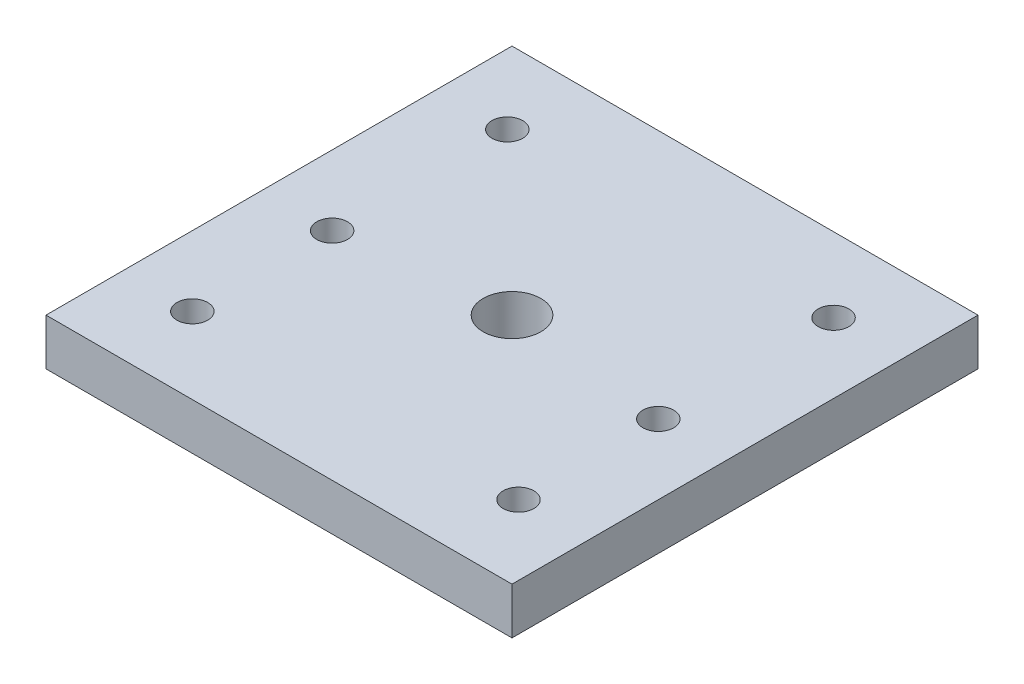
ISO-10303-21;
HEADER;
FILE_DESCRIPTION(('STEP AP214'),'2;1');
FILE_NAME('part.step','',(''),(''),'','','');
FILE_SCHEMA(('AUTOMOTIVE_DESIGN { 1 0 10303 214 1 1 1 1 }'));
ENDSEC;
DATA;
#1=APPLICATION_CONTEXT('core data for automotive mechanical design processes');
#2=APPLICATION_PROTOCOL_DEFINITION('international standard','automotive_design',2000,#1);
#3=PRODUCT_CONTEXT('',#1,'mechanical');
#4=PRODUCT('Part','Part','',(#3));
#5=PRODUCT_RELATED_PRODUCT_CATEGORY('part','',(#4));
#6=PRODUCT_DEFINITION_FORMATION('','',#4);
#7=PRODUCT_DEFINITION_CONTEXT('part definition',#1,'design');
#8=PRODUCT_DEFINITION('design','',#6,#7);
#9=PRODUCT_DEFINITION_SHAPE('','',#8);
#10=(LENGTH_UNIT() NAMED_UNIT(*) SI_UNIT(.MILLI.,.METRE.));
#11=(NAMED_UNIT(*) PLANE_ANGLE_UNIT() SI_UNIT($,.RADIAN.));
#12=(NAMED_UNIT(*) SI_UNIT($,.STERADIAN.) SOLID_ANGLE_UNIT());
#13=UNCERTAINTY_MEASURE_WITH_UNIT(LENGTH_MEASURE(1.E-05),#10,'distance_accuracy_value','');
#14=(GEOMETRIC_REPRESENTATION_CONTEXT(3) GLOBAL_UNCERTAINTY_ASSIGNED_CONTEXT((#13)) GLOBAL_UNIT_ASSIGNED_CONTEXT((#10,
#11,#12)) REPRESENTATION_CONTEXT('',''));
#15=CARTESIAN_POINT('',(0.,0.,0.));
#16=DIRECTION('',(0.,0.,1.));
#17=DIRECTION('',(1.,0.,0.));
#18=AXIS2_PLACEMENT_3D('',#15,#16,#17);
#19=CARTESIAN_POINT('',(-63.5,12.7,63.5));
#20=DIRECTION('',(1.,0.,0.));
#21=DIRECTION('',(0.,0.,-1.));
#22=AXIS2_PLACEMENT_3D('',#19,#20,#21);
#23=PLANE('',#22);
#24=DIRECTION('',(0.,0.,1.));
#25=VECTOR('',#24,1.);
#26=CARTESIAN_POINT('',(-63.5,0.,63.5));
#27=LINE('',#26,#25);
#28=CARTESIAN_POINT('',(-63.5,0.,-63.5));
#29=VERTEX_POINT('',#28);
#30=CARTESIAN_POINT('',(-63.5,0.,63.5));
#31=VERTEX_POINT('',#30);
#32=EDGE_CURVE('E107',#29,#31,#27,.T.);
#33=ORIENTED_EDGE('',*,*,#32,.T.);
#34=DIRECTION('',(0.,-1.,0.));
#35=VECTOR('',#34,1.);
#36=CARTESIAN_POINT('',(-63.5,12.7,63.5));
#37=LINE('',#36,#35);
#38=CARTESIAN_POINT('',(-63.5,12.7,63.5));
#39=VERTEX_POINT('',#38);
#40=EDGE_CURVE('E11',#39,#31,#37,.T.);
#41=ORIENTED_EDGE('',*,*,#40,.F.);
#42=DIRECTION('',(0.,0.,1.));
#43=VECTOR('',#42,1.);
#44=CARTESIAN_POINT('',(-63.5,12.7,63.5));
#45=LINE('',#44,#43);
#46=CARTESIAN_POINT('',(-63.5,12.7,-63.5));
#47=VERTEX_POINT('',#46);
#48=EDGE_CURVE('E91',#47,#39,#45,.T.);
#49=ORIENTED_EDGE('',*,*,#48,.F.);
#50=DIRECTION('',(0.,-1.,0.));
#51=VECTOR('',#50,1.);
#52=CARTESIAN_POINT('',(-63.5,12.7,-63.5));
#53=LINE('',#52,#51);
#54=EDGE_CURVE('E103',#47,#29,#53,.T.);
#55=ORIENTED_EDGE('',*,*,#54,.T.);
#56=EDGE_LOOP('',(#33,#41,#49,#55));
#57=FACE_BOUND('',#56,.T.);
#58=ADVANCED_FACE('F39',(#57),#23,.F.);
#59=CARTESIAN_POINT('',(63.5,12.7,63.5));
#60=DIRECTION('',(0.,0.,-1.));
#61=DIRECTION('',(-1.,0.,0.));
#62=AXIS2_PLACEMENT_3D('',#59,#60,#61);
#63=PLANE('',#62);
#64=DIRECTION('',(1.,0.,0.));
#65=VECTOR('',#64,1.);
#66=CARTESIAN_POINT('',(63.5,0.,63.5));
#67=LINE('',#66,#65);
#68=CARTESIAN_POINT('',(63.5,0.,63.5));
#69=VERTEX_POINT('',#68);
#70=EDGE_CURVE('E96',#31,#69,#67,.T.);
#71=ORIENTED_EDGE('',*,*,#70,.T.);
#72=DIRECTION('',(0.,-1.,0.));
#73=VECTOR('',#72,1.);
#74=CARTESIAN_POINT('',(63.5,12.7,63.5));
#75=LINE('',#74,#73);
#76=CARTESIAN_POINT('',(63.5,12.7,63.5));
#77=VERTEX_POINT('',#76);
#78=EDGE_CURVE('E48',#77,#69,#75,.T.);
#79=ORIENTED_EDGE('',*,*,#78,.F.);
#80=DIRECTION('',(1.,0.,0.));
#81=VECTOR('',#80,1.);
#82=CARTESIAN_POINT('',(63.5,12.7,63.5));
#83=LINE('',#82,#81);
#84=EDGE_CURVE('E86',#39,#77,#83,.T.);
#85=ORIENTED_EDGE('',*,*,#84,.F.);
#86=ORIENTED_EDGE('',*,*,#40,.T.);
#87=EDGE_LOOP('',(#71,#79,#85,#86));
#88=FACE_BOUND('',#87,.T.);
#89=ADVANCED_FACE('F95',(#88),#63,.F.);
#90=CARTESIAN_POINT('',(63.5,12.7,63.5));
#91=DIRECTION('',(-1.,0.,0.));
#92=DIRECTION('',(0.,0.,1.));
#93=AXIS2_PLACEMENT_3D('',#90,#91,#92);
#94=PLANE('',#93);
#95=DIRECTION('',(0.,0.,-1.));
#96=VECTOR('',#95,1.);
#97=CARTESIAN_POINT('',(63.5,0.,63.5));
#98=LINE('',#97,#96);
#99=CARTESIAN_POINT('',(63.5,0.,-63.5));
#100=VERTEX_POINT('',#99);
#101=EDGE_CURVE('E73',#69,#100,#98,.T.);
#102=ORIENTED_EDGE('',*,*,#101,.T.);
#103=DIRECTION('',(0.,-1.,0.));
#104=VECTOR('',#103,1.);
#105=CARTESIAN_POINT('',(63.5,12.7,-63.5));
#106=LINE('',#105,#104);
#107=CARTESIAN_POINT('',(63.5,12.7,-63.5));
#108=VERTEX_POINT('',#107);
#109=EDGE_CURVE('E98',#108,#100,#106,.T.);
#110=ORIENTED_EDGE('',*,*,#109,.F.);
#111=DIRECTION('',(0.,0.,-1.));
#112=VECTOR('',#111,1.);
#113=CARTESIAN_POINT('',(63.5,12.7,63.5));
#114=LINE('',#113,#112);
#115=EDGE_CURVE('E89',#77,#108,#114,.T.);
#116=ORIENTED_EDGE('',*,*,#115,.F.);
#117=ORIENTED_EDGE('',*,*,#78,.T.);
#118=EDGE_LOOP('',(#102,#110,#116,#117));
#119=FACE_BOUND('',#118,.T.);
#120=ADVANCED_FACE('F99',(#119),#94,.F.);
#121=CARTESIAN_POINT('',(63.5,12.7,-63.5));
#122=DIRECTION('',(0.,0.,1.));
#123=DIRECTION('',(1.,0.,0.));
#124=AXIS2_PLACEMENT_3D('',#121,#122,#123);
#125=PLANE('',#124);
#126=DIRECTION('',(-1.,0.,0.));
#127=VECTOR('',#126,1.);
#128=CARTESIAN_POINT('',(63.5,0.,-63.5));
#129=LINE('',#128,#127);
#130=EDGE_CURVE('E79',#100,#29,#129,.T.);
#131=ORIENTED_EDGE('',*,*,#130,.T.);
#132=ORIENTED_EDGE('',*,*,#54,.F.);
#133=DIRECTION('',(-1.,0.,0.));
#134=VECTOR('',#133,1.);
#135=CARTESIAN_POINT('',(63.5,12.7,-63.5));
#136=LINE('',#135,#134);
#137=EDGE_CURVE('E56',#108,#47,#136,.T.);
#138=ORIENTED_EDGE('',*,*,#137,.F.);
#139=ORIENTED_EDGE('',*,*,#109,.T.);
#140=EDGE_LOOP('',(#131,#132,#138,#139));
#141=FACE_BOUND('',#140,.T.);
#142=ADVANCED_FACE('F121',(#141),#125,.F.);
#143=CARTESIAN_POINT('',(0.,12.7,0.));
#144=DIRECTION('',(0.,1.,0.));
#145=DIRECTION('',(0.,0.,1.));
#146=AXIS2_PLACEMENT_3D('',#143,#144,#145);
#147=PLANE('',#146);
#148=CARTESIAN_POINT('',(0.,12.7,0.));
#149=DIRECTION('',(0.,-1.,0.));
#150=DIRECTION('',(0.,0.,-1.));
#151=AXIS2_PLACEMENT_3D('',#148,#149,#150);
#152=CIRCLE('',#151,7.874);
#153=CARTESIAN_POINT('',(0.,12.7,-7.874));
#154=VERTEX_POINT('',#153);
#155=EDGE_CURVE('E175',#154,#154,#152,.T.);
#156=ORIENTED_EDGE('',*,*,#155,.T.);
#157=EDGE_LOOP('',(#156));
#158=FACE_BOUND('',#157,.T.);
#159=CARTESIAN_POINT('',(44.45,12.7,-43.18));
#160=DIRECTION('',(0.,-1.,0.));
#161=DIRECTION('',(0.,0.,-1.));
#162=AXIS2_PLACEMENT_3D('',#159,#160,#161);
#163=CIRCLE('',#162,4.191);
#164=CARTESIAN_POINT('',(44.45,12.7,-47.371));
#165=VERTEX_POINT('',#164);
#166=EDGE_CURVE('E167',#165,#165,#163,.T.);
#167=ORIENTED_EDGE('',*,*,#166,.T.);
#168=EDGE_LOOP('',(#167));
#169=FACE_BOUND('',#168,.T.);
#170=CARTESIAN_POINT('',(44.45,12.7,4.572));
#171=DIRECTION('',(0.,-1.,0.));
#172=DIRECTION('',(0.,0.,-1.));
#173=AXIS2_PLACEMENT_3D('',#170,#171,#172);
#174=CIRCLE('',#173,4.191);
#175=CARTESIAN_POINT('',(44.45,12.7,0.381000000000003));
#176=VERTEX_POINT('',#175);
#177=EDGE_CURVE('E159',#176,#176,#174,.T.);
#178=ORIENTED_EDGE('',*,*,#177,.T.);
#179=EDGE_LOOP('',(#178));
#180=FACE_BOUND('',#179,.T.);
#181=CARTESIAN_POINT('',(44.45,12.7,42.672));
#182=DIRECTION('',(0.,-1.,0.));
#183=DIRECTION('',(0.,0.,-1.));
#184=AXIS2_PLACEMENT_3D('',#181,#182,#183);
#185=CIRCLE('',#184,4.191);
#186=CARTESIAN_POINT('',(44.45,12.7,38.481));
#187=VERTEX_POINT('',#186);
#188=EDGE_CURVE('E151',#187,#187,#185,.T.);
#189=ORIENTED_EDGE('',*,*,#188,.T.);
#190=EDGE_LOOP('',(#189));
#191=FACE_BOUND('',#190,.T.);
#192=CARTESIAN_POINT('',(-44.45,12.7,-43.18));
#193=DIRECTION('',(0.,-1.,0.));
#194=DIRECTION('',(0.,0.,-1.));
#195=AXIS2_PLACEMENT_3D('',#192,#193,#194);
#196=CIRCLE('',#195,4.191);
#197=CARTESIAN_POINT('',(-44.45,12.7,-47.371));
#198=VERTEX_POINT('',#197);
#199=EDGE_CURVE('E143',#198,#198,#196,.T.);
#200=ORIENTED_EDGE('',*,*,#199,.T.);
#201=EDGE_LOOP('',(#200));
#202=FACE_BOUND('',#201,.T.);
#203=CARTESIAN_POINT('',(-44.45,12.7,4.572));
#204=DIRECTION('',(0.,-1.,0.));
#205=DIRECTION('',(0.,0.,-1.));
#206=AXIS2_PLACEMENT_3D('',#203,#204,#205);
#207=CIRCLE('',#206,4.19099999999999);
#208=CARTESIAN_POINT('',(-44.45,12.7,0.381000000000006));
#209=VERTEX_POINT('',#208);
#210=EDGE_CURVE('E135',#209,#209,#207,.T.);
#211=ORIENTED_EDGE('',*,*,#210,.T.);
#212=EDGE_LOOP('',(#211));
#213=FACE_BOUND('',#212,.T.);
#214=CARTESIAN_POINT('',(-44.45,12.7,42.672));
#215=DIRECTION('',(0.,-1.,0.));
#216=DIRECTION('',(0.,0.,-1.));
#217=AXIS2_PLACEMENT_3D('',#214,#215,#216);
#218=CIRCLE('',#217,4.191);
#219=CARTESIAN_POINT('',(-44.45,12.7,38.481));
#220=VERTEX_POINT('',#219);
#221=EDGE_CURVE('E111',#220,#220,#218,.T.);
#222=ORIENTED_EDGE('',*,*,#221,.T.);
#223=EDGE_LOOP('',(#222));
#224=FACE_BOUND('',#223,.T.);
#225=ORIENTED_EDGE('',*,*,#48,.T.);
#226=ORIENTED_EDGE('',*,*,#84,.T.);
#227=ORIENTED_EDGE('',*,*,#115,.T.);
#228=ORIENTED_EDGE('',*,*,#137,.T.);
#229=EDGE_LOOP('',(#225,#226,#227,#228));
#230=FACE_BOUND('',#229,.T.);
#231=ADVANCED_FACE('F87',(#158,#169,#180,#191,#202,#213,#224,#230),#147,.T.);
#232=CARTESIAN_POINT('',(0.,0.,0.));
#233=DIRECTION('',(0.,1.,0.));
#234=DIRECTION('',(0.,0.,1.));
#235=AXIS2_PLACEMENT_3D('',#232,#233,#234);
#236=PLANE('',#235);
#237=CARTESIAN_POINT('',(0.,0.,0.));
#238=DIRECTION('',(0.,-1.,0.));
#239=DIRECTION('',(0.,0.,-1.));
#240=AXIS2_PLACEMENT_3D('',#237,#238,#239);
#241=CIRCLE('',#240,7.874);
#242=CARTESIAN_POINT('',(0.,0.,-7.874));
#243=VERTEX_POINT('',#242);
#244=EDGE_CURVE('E176',#243,#243,#241,.T.);
#245=ORIENTED_EDGE('',*,*,#244,.F.);
#246=EDGE_LOOP('',(#245));
#247=FACE_BOUND('',#246,.T.);
#248=CARTESIAN_POINT('',(44.45,0.,-43.18));
#249=DIRECTION('',(0.,-1.,0.));
#250=DIRECTION('',(0.,0.,-1.));
#251=AXIS2_PLACEMENT_3D('',#248,#249,#250);
#252=CIRCLE('',#251,4.191);
#253=CARTESIAN_POINT('',(44.45,0.,-47.371));
#254=VERTEX_POINT('',#253);
#255=EDGE_CURVE('E171',#254,#254,#252,.T.);
#256=ORIENTED_EDGE('',*,*,#255,.F.);
#257=EDGE_LOOP('',(#256));
#258=FACE_BOUND('',#257,.T.);
#259=CARTESIAN_POINT('',(44.45,0.,4.572));
#260=DIRECTION('',(0.,-1.,0.));
#261=DIRECTION('',(0.,0.,-1.));
#262=AXIS2_PLACEMENT_3D('',#259,#260,#261);
#263=CIRCLE('',#262,4.191);
#264=CARTESIAN_POINT('',(44.45,0.,0.381000000000003));
#265=VERTEX_POINT('',#264);
#266=EDGE_CURVE('E163',#265,#265,#263,.T.);
#267=ORIENTED_EDGE('',*,*,#266,.F.);
#268=EDGE_LOOP('',(#267));
#269=FACE_BOUND('',#268,.T.);
#270=CARTESIAN_POINT('',(44.45,0.,42.672));
#271=DIRECTION('',(0.,-1.,0.));
#272=DIRECTION('',(0.,0.,-1.));
#273=AXIS2_PLACEMENT_3D('',#270,#271,#272);
#274=CIRCLE('',#273,4.191);
#275=CARTESIAN_POINT('',(44.45,0.,38.481));
#276=VERTEX_POINT('',#275);
#277=EDGE_CURVE('E155',#276,#276,#274,.T.);
#278=ORIENTED_EDGE('',*,*,#277,.F.);
#279=EDGE_LOOP('',(#278));
#280=FACE_BOUND('',#279,.T.);
#281=CARTESIAN_POINT('',(-44.45,0.,-43.18));
#282=DIRECTION('',(0.,-1.,0.));
#283=DIRECTION('',(0.,0.,-1.));
#284=AXIS2_PLACEMENT_3D('',#281,#282,#283);
#285=CIRCLE('',#284,4.191);
#286=CARTESIAN_POINT('',(-44.45,0.,-47.371));
#287=VERTEX_POINT('',#286);
#288=EDGE_CURVE('E147',#287,#287,#285,.T.);
#289=ORIENTED_EDGE('',*,*,#288,.F.);
#290=EDGE_LOOP('',(#289));
#291=FACE_BOUND('',#290,.T.);
#292=CARTESIAN_POINT('',(-44.45,0.,4.572));
#293=DIRECTION('',(0.,-1.,0.));
#294=DIRECTION('',(0.,0.,-1.));
#295=AXIS2_PLACEMENT_3D('',#292,#293,#294);
#296=CIRCLE('',#295,4.191);
#297=CARTESIAN_POINT('',(-44.45,0.,0.380999999999999));
#298=VERTEX_POINT('',#297);
#299=EDGE_CURVE('E139',#298,#298,#296,.T.);
#300=ORIENTED_EDGE('',*,*,#299,.F.);
#301=EDGE_LOOP('',(#300));
#302=FACE_BOUND('',#301,.T.);
#303=CARTESIAN_POINT('',(-44.45,0.,42.672));
#304=DIRECTION('',(0.,-1.,0.));
#305=DIRECTION('',(0.,0.,-1.));
#306=AXIS2_PLACEMENT_3D('',#303,#304,#305);
#307=CIRCLE('',#306,4.191);
#308=CARTESIAN_POINT('',(-44.45,0.,38.481));
#309=VERTEX_POINT('',#308);
#310=EDGE_CURVE('E131',#309,#309,#307,.T.);
#311=ORIENTED_EDGE('',*,*,#310,.F.);
#312=EDGE_LOOP('',(#311));
#313=FACE_BOUND('',#312,.T.);
#314=ORIENTED_EDGE('',*,*,#32,.F.);
#315=ORIENTED_EDGE('',*,*,#130,.F.);
#316=ORIENTED_EDGE('',*,*,#101,.F.);
#317=ORIENTED_EDGE('',*,*,#70,.F.);
#318=EDGE_LOOP('',(#314,#315,#316,#317));
#319=FACE_BOUND('',#318,.T.);
#320=ADVANCED_FACE('F124',(#247,#258,#269,#280,#291,#302,#313,#319),#236,.F.);
#321=CARTESIAN_POINT('',(-44.45,0.,42.672));
#322=DIRECTION('',(0.,-1.,0.));
#323=DIRECTION('',(0.,0.,-1.));
#324=AXIS2_PLACEMENT_3D('',#321,#322,#323);
#325=CYLINDRICAL_SURFACE('',#324,4.191);
#326=ORIENTED_EDGE('',*,*,#221,.F.);
#327=EDGE_LOOP('',(#326));
#328=FACE_BOUND('',#327,.T.);
#329=ORIENTED_EDGE('',*,*,#310,.T.);
#330=EDGE_LOOP('',(#329));
#331=FACE_BOUND('',#330,.T.);
#332=ADVANCED_FACE('F195',(#328,#331),#325,.F.);
#333=CARTESIAN_POINT('',(-44.45,0.,4.572));
#334=DIRECTION('',(0.,-1.,0.));
#335=DIRECTION('',(0.,0.,-1.));
#336=AXIS2_PLACEMENT_3D('',#333,#334,#335);
#337=CYLINDRICAL_SURFACE('',#336,4.191);
#338=ORIENTED_EDGE('',*,*,#210,.F.);
#339=EDGE_LOOP('',(#338));
#340=FACE_BOUND('',#339,.T.);
#341=ORIENTED_EDGE('',*,*,#299,.T.);
#342=EDGE_LOOP('',(#341));
#343=FACE_BOUND('',#342,.T.);
#344=ADVANCED_FACE('F210',(#340,#343),#337,.F.);
#345=CARTESIAN_POINT('',(-44.45,0.,-43.18));
#346=DIRECTION('',(0.,-1.,0.));
#347=DIRECTION('',(0.,0.,-1.));
#348=AXIS2_PLACEMENT_3D('',#345,#346,#347);
#349=CYLINDRICAL_SURFACE('',#348,4.191);
#350=ORIENTED_EDGE('',*,*,#199,.F.);
#351=EDGE_LOOP('',(#350));
#352=FACE_BOUND('',#351,.T.);
#353=ORIENTED_EDGE('',*,*,#288,.T.);
#354=EDGE_LOOP('',(#353));
#355=FACE_BOUND('',#354,.T.);
#356=ADVANCED_FACE('F216',(#352,#355),#349,.F.);
#357=CARTESIAN_POINT('',(44.45,0.,42.672));
#358=DIRECTION('',(0.,-1.,0.));
#359=DIRECTION('',(0.,0.,-1.));
#360=AXIS2_PLACEMENT_3D('',#357,#358,#359);
#361=CYLINDRICAL_SURFACE('',#360,4.191);
#362=ORIENTED_EDGE('',*,*,#188,.F.);
#363=EDGE_LOOP('',(#362));
#364=FACE_BOUND('',#363,.T.);
#365=ORIENTED_EDGE('',*,*,#277,.T.);
#366=EDGE_LOOP('',(#365));
#367=FACE_BOUND('',#366,.T.);
#368=ADVANCED_FACE('F263',(#364,#367),#361,.F.);
#369=CARTESIAN_POINT('',(44.45,0.,4.572));
#370=DIRECTION('',(0.,-1.,0.));
#371=DIRECTION('',(0.,0.,-1.));
#372=AXIS2_PLACEMENT_3D('',#369,#370,#371);
#373=CYLINDRICAL_SURFACE('',#372,4.191);
#374=ORIENTED_EDGE('',*,*,#177,.F.);
#375=EDGE_LOOP('',(#374));
#376=FACE_BOUND('',#375,.T.);
#377=ORIENTED_EDGE('',*,*,#266,.T.);
#378=EDGE_LOOP('',(#377));
#379=FACE_BOUND('',#378,.T.);
#380=ADVANCED_FACE('F256',(#376,#379),#373,.F.);
#381=CARTESIAN_POINT('',(44.45,0.,-43.18));
#382=DIRECTION('',(0.,-1.,0.));
#383=DIRECTION('',(0.,0.,-1.));
#384=AXIS2_PLACEMENT_3D('',#381,#382,#383);
#385=CYLINDRICAL_SURFACE('',#384,4.191);
#386=ORIENTED_EDGE('',*,*,#166,.F.);
#387=EDGE_LOOP('',(#386));
#388=FACE_BOUND('',#387,.T.);
#389=ORIENTED_EDGE('',*,*,#255,.T.);
#390=EDGE_LOOP('',(#389));
#391=FACE_BOUND('',#390,.T.);
#392=ADVANCED_FACE('F189',(#388,#391),#385,.F.);
#393=CARTESIAN_POINT('',(0.,12.7,0.));
#394=DIRECTION('',(0.,-1.,0.));
#395=DIRECTION('',(0.,0.,-1.));
#396=AXIS2_PLACEMENT_3D('',#393,#394,#395);
#397=CYLINDRICAL_SURFACE('',#396,7.874);
#398=ORIENTED_EDGE('',*,*,#155,.F.);
#399=EDGE_LOOP('',(#398));
#400=FACE_BOUND('',#399,.T.);
#401=ORIENTED_EDGE('',*,*,#244,.T.);
#402=EDGE_LOOP('',(#401));
#403=FACE_BOUND('',#402,.T.);
#404=ADVANCED_FACE('F186',(#400,#403),#397,.F.);
#405=CLOSED_SHELL('',(#58,#89,#120,#142,#231,#320,#332,#344,#356,#368,#380,#392,#404));
#406=MANIFOLD_SOLID_BREP('B2',#405);
#407=ADVANCED_BREP_SHAPE_REPRESENTATION('',(#18,#406),#14);
#408=SHAPE_DEFINITION_REPRESENTATION(#9,#407);
ENDSEC;
END-ISO-10303-21;
